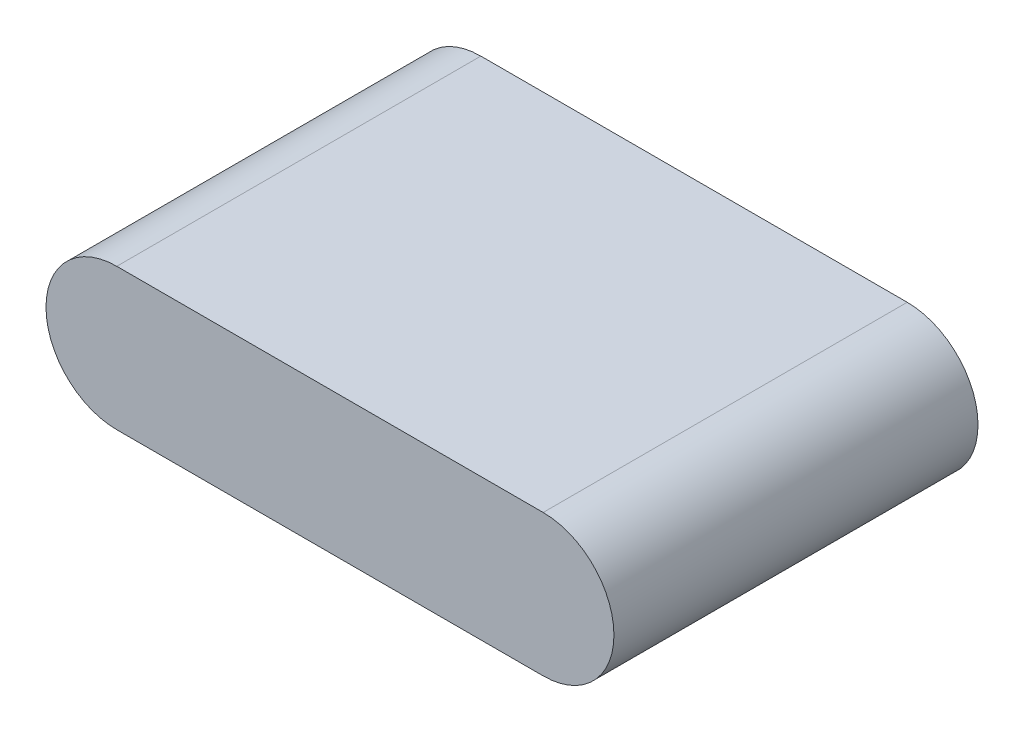
ISO-10303-21;
HEADER;
FILE_DESCRIPTION(('STEP AP214'),'2;1');
FILE_NAME('part.step','',(''),(''),'','','');
FILE_SCHEMA(('AUTOMOTIVE_DESIGN { 1 0 10303 214 1 1 1 1 }'));
ENDSEC;
DATA;
#1=APPLICATION_CONTEXT('core data for automotive mechanical design processes');
#2=APPLICATION_PROTOCOL_DEFINITION('international standard','automotive_design',2000,#1);
#3=PRODUCT_CONTEXT('',#1,'mechanical');
#4=PRODUCT('Part','Part','',(#3));
#5=PRODUCT_RELATED_PRODUCT_CATEGORY('part','',(#4));
#6=PRODUCT_DEFINITION_FORMATION('','',#4);
#7=PRODUCT_DEFINITION_CONTEXT('part definition',#1,'design');
#8=PRODUCT_DEFINITION('design','',#6,#7);
#9=PRODUCT_DEFINITION_SHAPE('','',#8);
#10=(LENGTH_UNIT() NAMED_UNIT(*) SI_UNIT(.MILLI.,.METRE.));
#11=(NAMED_UNIT(*) PLANE_ANGLE_UNIT() SI_UNIT($,.RADIAN.));
#12=(NAMED_UNIT(*) SI_UNIT($,.STERADIAN.) SOLID_ANGLE_UNIT());
#13=UNCERTAINTY_MEASURE_WITH_UNIT(LENGTH_MEASURE(1.E-05),#10,'distance_accuracy_value','');
#14=(GEOMETRIC_REPRESENTATION_CONTEXT(3) GLOBAL_UNCERTAINTY_ASSIGNED_CONTEXT((#13)) GLOBAL_UNIT_ASSIGNED_CONTEXT((#10,
#11,#12)) REPRESENTATION_CONTEXT('',''));
#15=CARTESIAN_POINT('',(0.,0.,0.));
#16=DIRECTION('',(0.,0.,1.));
#17=DIRECTION('',(1.,0.,0.));
#18=AXIS2_PLACEMENT_3D('',#15,#16,#17);
#19=CARTESIAN_POINT('',(5.388556563001,3.456935755002,0.));
#20=DIRECTION('',(0.,1.,0.));
#21=DIRECTION('',(0.,0.,1.));
#22=AXIS2_PLACEMENT_3D('',#19,#20,#21);
#23=PLANE('',#22);
#24=DIRECTION('',(1.,0.,0.));
#25=VECTOR('',#24,1.);
#26=CARTESIAN_POINT('',(5.329996563001,3.456935755002,0.1));
#27=LINE('',#26,#25);
#28=CARTESIAN_POINT('',(5.388556563001,3.456935755002,0.1));
#29=VERTEX_POINT('',#28);
#30=CARTESIAN_POINT('',(5.271436563001,3.456935755002,0.1));
#31=VERTEX_POINT('',#30);
#32=EDGE_CURVE('E84',#29,#31,#27,.F.);
#33=ORIENTED_EDGE('',*,*,#32,.F.);
#34=DIRECTION('',(0.,0.,1.));
#35=VECTOR('',#34,1.);
#36=CARTESIAN_POINT('',(5.388556563001,3.456935755002,0.));
#37=LINE('',#36,#35);
#38=CARTESIAN_POINT('',(5.388556563001,3.456935755002,0.));
#39=VERTEX_POINT('',#38);
#40=EDGE_CURVE('E64',#39,#29,#37,.T.);
#41=ORIENTED_EDGE('',*,*,#40,.F.);
#42=DIRECTION('',(1.,0.,0.));
#43=VECTOR('',#42,1.);
#44=CARTESIAN_POINT('',(5.329996563001,3.456935755002,0.));
#45=LINE('',#44,#43);
#46=CARTESIAN_POINT('',(5.271436563001,3.456935755002,0.));
#47=VERTEX_POINT('',#46);
#48=EDGE_CURVE('E61',#39,#47,#45,.F.);
#49=ORIENTED_EDGE('',*,*,#48,.T.);
#50=DIRECTION('',(0.,0.,1.));
#51=VECTOR('',#50,1.);
#52=CARTESIAN_POINT('',(5.271436563001,3.456935755002,0.));
#53=LINE('',#52,#51);
#54=EDGE_CURVE('E74',#31,#47,#53,.F.);
#55=ORIENTED_EDGE('',*,*,#54,.F.);
#56=EDGE_LOOP('',(#33,#41,#49,#55));
#57=FACE_BOUND('',#56,.T.);
#58=ADVANCED_FACE('F17',(#57),#23,.T.);
#59=CARTESIAN_POINT('',(5.329996563001,3.437495755002,0.));
#60=DIRECTION('',(0.,0.,1.));
#61=DIRECTION('',(1.,0.,0.));
#62=AXIS2_PLACEMENT_3D('',#59,#60,#61);
#63=PLANE('',#62);
#64=DIRECTION('',(1.,0.,0.));
#65=VECTOR('',#64,1.);
#66=CARTESIAN_POINT('',(5.271436563001,3.418055755002,0.));
#67=LINE('',#66,#65);
#68=CARTESIAN_POINT('',(5.271436563001,3.418055755002,0.));
#69=VERTEX_POINT('',#68);
#70=CARTESIAN_POINT('',(5.388556563001,3.418055755002,0.));
#71=VERTEX_POINT('',#70);
#72=EDGE_CURVE('E59',#69,#71,#67,.T.);
#73=ORIENTED_EDGE('',*,*,#72,.F.);
#74=CARTESIAN_POINT('',(5.271436563001,3.437495755002,0.));
#75=DIRECTION('',(0.,0.,1.));
#76=DIRECTION('',(1.,0.,0.));
#77=AXIS2_PLACEMENT_3D('',#74,#75,#76);
#78=CIRCLE('',#77,0.01944);
#79=EDGE_CURVE('E83',#47,#69,#78,.T.);
#80=ORIENTED_EDGE('',*,*,#79,.F.);
#81=ORIENTED_EDGE('',*,*,#48,.F.);
#82=CARTESIAN_POINT('',(5.388556563001,3.437495755002,0.));
#83=DIRECTION('',(0.,0.,1.));
#84=DIRECTION('',(1.,0.,0.));
#85=AXIS2_PLACEMENT_3D('',#82,#83,#84);
#86=CIRCLE('',#85,0.01944);
#87=EDGE_CURVE('E20',#71,#39,#86,.T.);
#88=ORIENTED_EDGE('',*,*,#87,.F.);
#89=EDGE_LOOP('',(#73,#80,#81,#88));
#90=FACE_BOUND('',#89,.T.);
#91=ADVANCED_FACE('F56',(#90),#63,.F.);
#92=CARTESIAN_POINT('',(5.388556563001,3.437495755002,0.));
#93=DIRECTION('',(0.,0.,1.));
#94=DIRECTION('',(1.,0.,0.));
#95=AXIS2_PLACEMENT_3D('',#92,#93,#94);
#96=CYLINDRICAL_SURFACE('',#95,0.01944);
#97=CARTESIAN_POINT('',(5.388556563001,3.437495755002,0.1));
#98=DIRECTION('',(0.,0.,1.));
#99=DIRECTION('',(1.,0.,0.));
#100=AXIS2_PLACEMENT_3D('',#97,#98,#99);
#101=CIRCLE('',#100,0.01944);
#102=CARTESIAN_POINT('',(5.388556563001,3.418055755002,0.1));
#103=VERTEX_POINT('',#102);
#104=EDGE_CURVE('E69',#103,#29,#101,.T.);
#105=ORIENTED_EDGE('',*,*,#104,.F.);
#106=DIRECTION('',(0.,0.,-1.));
#107=VECTOR('',#106,1.);
#108=CARTESIAN_POINT('',(5.388556563001,3.418055755002,0.));
#109=LINE('',#108,#107);
#110=EDGE_CURVE('E66',#71,#103,#109,.F.);
#111=ORIENTED_EDGE('',*,*,#110,.F.);
#112=ORIENTED_EDGE('',*,*,#87,.T.);
#113=ORIENTED_EDGE('',*,*,#40,.T.);
#114=EDGE_LOOP('',(#105,#111,#112,#113));
#115=FACE_BOUND('',#114,.T.);
#116=ADVANCED_FACE('F67',(#115),#96,.T.);
#117=CARTESIAN_POINT('',(5.329996563001,3.437495755002,0.1));
#118=DIRECTION('',(0.,0.,1.));
#119=DIRECTION('',(1.,0.,0.));
#120=AXIS2_PLACEMENT_3D('',#117,#118,#119);
#121=PLANE('',#120);
#122=CARTESIAN_POINT('',(5.271436563001,3.437495755002,0.1));
#123=DIRECTION('',(0.,0.,1.));
#124=DIRECTION('',(1.,0.,0.));
#125=AXIS2_PLACEMENT_3D('',#122,#123,#124);
#126=CIRCLE('',#125,0.01944);
#127=CARTESIAN_POINT('',(5.271436563001,3.418055755002,0.1));
#128=VERTEX_POINT('',#127);
#129=EDGE_CURVE('E35',#128,#31,#126,.F.);
#130=ORIENTED_EDGE('',*,*,#129,.F.);
#131=DIRECTION('',(1.,0.,0.));
#132=VECTOR('',#131,1.);
#133=CARTESIAN_POINT('',(5.271436563001,3.418055755002,0.1));
#134=LINE('',#133,#132);
#135=EDGE_CURVE('E26',#103,#128,#134,.F.);
#136=ORIENTED_EDGE('',*,*,#135,.F.);
#137=ORIENTED_EDGE('',*,*,#104,.T.);
#138=ORIENTED_EDGE('',*,*,#32,.T.);
#139=EDGE_LOOP('',(#130,#136,#137,#138));
#140=FACE_BOUND('',#139,.T.);
#141=ADVANCED_FACE('F88',(#140),#121,.T.);
#142=CARTESIAN_POINT('',(5.271436563001,3.437495755002,0.));
#143=DIRECTION('',(0.,0.,1.));
#144=DIRECTION('',(1.,0.,0.));
#145=AXIS2_PLACEMENT_3D('',#142,#143,#144);
#146=CYLINDRICAL_SURFACE('',#145,0.01944);
#147=ORIENTED_EDGE('',*,*,#129,.T.);
#148=ORIENTED_EDGE('',*,*,#54,.T.);
#149=ORIENTED_EDGE('',*,*,#79,.T.);
#150=DIRECTION('',(0.,0.,-1.));
#151=VECTOR('',#150,1.);
#152=CARTESIAN_POINT('',(5.271436563001,3.418055755002,0.));
#153=LINE('',#152,#151);
#154=EDGE_CURVE('E11',#128,#69,#153,.T.);
#155=ORIENTED_EDGE('',*,*,#154,.F.);
#156=EDGE_LOOP('',(#147,#148,#149,#155));
#157=FACE_BOUND('',#156,.T.);
#158=ADVANCED_FACE('F90',(#157),#146,.T.);
#159=CARTESIAN_POINT('',(5.271436563001,3.418055755002,0.));
#160=DIRECTION('',(0.,-1.,0.));
#161=DIRECTION('',(0.,0.,-1.));
#162=AXIS2_PLACEMENT_3D('',#159,#160,#161);
#163=PLANE('',#162);
#164=ORIENTED_EDGE('',*,*,#135,.T.);
#165=ORIENTED_EDGE('',*,*,#154,.T.);
#166=ORIENTED_EDGE('',*,*,#72,.T.);
#167=ORIENTED_EDGE('',*,*,#110,.T.);
#168=EDGE_LOOP('',(#164,#165,#166,#167));
#169=FACE_BOUND('',#168,.T.);
#170=ADVANCED_FACE('F73',(#169),#163,.T.);
#171=CLOSED_SHELL('',(#58,#91,#116,#141,#158,#170));
#172=MANIFOLD_SOLID_BREP('B1',#171);
#173=ADVANCED_BREP_SHAPE_REPRESENTATION('',(#18,#172),#14);
#174=SHAPE_DEFINITION_REPRESENTATION(#9,#173);
ENDSEC;
END-ISO-10303-21;
